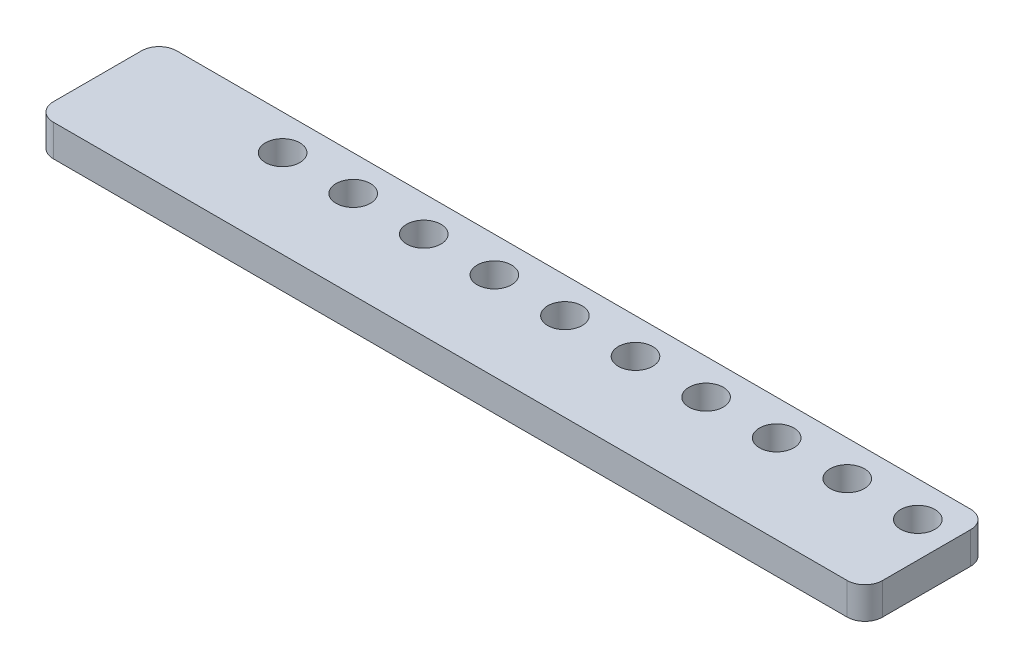
ISO-10303-21;
HEADER;
FILE_DESCRIPTION(('STEP AP214'),'2;1');
FILE_NAME('part.step','',(''),(''),'','','');
FILE_SCHEMA(('AUTOMOTIVE_DESIGN { 1 0 10303 214 1 1 1 1 }'));
ENDSEC;
DATA;
#1=APPLICATION_CONTEXT('core data for automotive mechanical design processes');
#2=APPLICATION_PROTOCOL_DEFINITION('international standard','automotive_design',2000,#1);
#3=PRODUCT_CONTEXT('',#1,'mechanical');
#4=PRODUCT('Part','Part','',(#3));
#5=PRODUCT_RELATED_PRODUCT_CATEGORY('part','',(#4));
#6=PRODUCT_DEFINITION_FORMATION('','',#4);
#7=PRODUCT_DEFINITION_CONTEXT('part definition',#1,'design');
#8=PRODUCT_DEFINITION('design','',#6,#7);
#9=PRODUCT_DEFINITION_SHAPE('','',#8);
#10=(LENGTH_UNIT() NAMED_UNIT(*) SI_UNIT(.MILLI.,.METRE.));
#11=(NAMED_UNIT(*) PLANE_ANGLE_UNIT() SI_UNIT($,.RADIAN.));
#12=(NAMED_UNIT(*) SI_UNIT($,.STERADIAN.) SOLID_ANGLE_UNIT());
#13=UNCERTAINTY_MEASURE_WITH_UNIT(LENGTH_MEASURE(1.E-05),#10,'distance_accuracy_value','');
#14=(GEOMETRIC_REPRESENTATION_CONTEXT(3) GLOBAL_UNCERTAINTY_ASSIGNED_CONTEXT((#13)) GLOBAL_UNIT_ASSIGNED_CONTEXT((#10,
#11,#12)) REPRESENTATION_CONTEXT('',''));
#15=CARTESIAN_POINT('',(0.,0.,0.));
#16=DIRECTION('',(0.,0.,1.));
#17=DIRECTION('',(1.,0.,0.));
#18=AXIS2_PLACEMENT_3D('',#15,#16,#17);
#19=CARTESIAN_POINT('',(92.,3.6,12.));
#20=DIRECTION('',(0.,-1.,0.));
#21=DIRECTION('',(0.,0.,-1.));
#22=AXIS2_PLACEMENT_3D('',#19,#20,#21);
#23=CYLINDRICAL_SURFACE('',#22,2.);
#24=CARTESIAN_POINT('',(92.,0.,12.));
#25=DIRECTION('',(0.,1.,0.));
#26=DIRECTION('',(0.,0.,1.));
#27=AXIS2_PLACEMENT_3D('',#24,#25,#26);
#28=CIRCLE('',#27,2.);
#29=CARTESIAN_POINT('',(92.,0.,14.));
#30=VERTEX_POINT('',#29);
#31=CARTESIAN_POINT('',(94.,0.,12.));
#32=VERTEX_POINT('',#31);
#33=EDGE_CURVE('E129',#30,#32,#28,.T.);
#34=ORIENTED_EDGE('',*,*,#33,.T.);
#35=DIRECTION('',(0.,-1.,0.));
#36=VECTOR('',#35,1.);
#37=CARTESIAN_POINT('',(94.,3.6,12.));
#38=LINE('',#37,#36);
#39=CARTESIAN_POINT('',(94.,3.6,12.));
#40=VERTEX_POINT('',#39);
#41=EDGE_CURVE('E11',#40,#32,#38,.T.);
#42=ORIENTED_EDGE('',*,*,#41,.F.);
#43=CARTESIAN_POINT('',(92.,3.6,12.));
#44=DIRECTION('',(0.,1.,0.));
#45=DIRECTION('',(0.,0.,1.));
#46=AXIS2_PLACEMENT_3D('',#43,#44,#45);
#47=CIRCLE('',#46,2.);
#48=CARTESIAN_POINT('',(92.,3.6,14.));
#49=VERTEX_POINT('',#48);
#50=EDGE_CURVE('E144',#49,#40,#47,.T.);
#51=ORIENTED_EDGE('',*,*,#50,.F.);
#52=DIRECTION('',(0.,-1.,0.));
#53=VECTOR('',#52,1.);
#54=CARTESIAN_POINT('',(92.,3.6,14.));
#55=LINE('',#54,#53);
#56=EDGE_CURVE('E125',#49,#30,#55,.T.);
#57=ORIENTED_EDGE('',*,*,#56,.T.);
#58=EDGE_LOOP('',(#34,#42,#51,#57));
#59=FACE_BOUND('',#58,.T.);
#60=ADVANCED_FACE('F33',(#59),#23,.T.);
#61=CARTESIAN_POINT('',(94.,3.6,2.));
#62=DIRECTION('',(-1.,0.,0.));
#63=DIRECTION('',(0.,0.,1.));
#64=AXIS2_PLACEMENT_3D('',#61,#62,#63);
#65=PLANE('',#64);
#66=DIRECTION('',(0.,0.,-1.));
#67=VECTOR('',#66,1.);
#68=CARTESIAN_POINT('',(94.,0.,2.));
#69=LINE('',#68,#67);
#70=CARTESIAN_POINT('',(94.,0.,2.));
#71=VERTEX_POINT('',#70);
#72=EDGE_CURVE('E132',#32,#71,#69,.T.);
#73=ORIENTED_EDGE('',*,*,#72,.T.);
#74=DIRECTION('',(0.,-1.,0.));
#75=VECTOR('',#74,1.);
#76=CARTESIAN_POINT('',(94.,3.6,2.));
#77=LINE('',#76,#75);
#78=CARTESIAN_POINT('',(94.,3.6,2.));
#79=VERTEX_POINT('',#78);
#80=EDGE_CURVE('E41',#79,#71,#77,.T.);
#81=ORIENTED_EDGE('',*,*,#80,.F.);
#82=DIRECTION('',(0.,0.,-1.));
#83=VECTOR('',#82,1.);
#84=CARTESIAN_POINT('',(94.,3.6,2.));
#85=LINE('',#84,#83);
#86=EDGE_CURVE('E92',#40,#79,#85,.T.);
#87=ORIENTED_EDGE('',*,*,#86,.F.);
#88=ORIENTED_EDGE('',*,*,#41,.T.);
#89=EDGE_LOOP('',(#73,#81,#87,#88));
#90=FACE_BOUND('',#89,.T.);
#91=ADVANCED_FACE('F284',(#90),#65,.F.);
#92=CARTESIAN_POINT('',(92.,3.6,2.));
#93=DIRECTION('',(0.,-1.,0.));
#94=DIRECTION('',(0.,0.,-1.));
#95=AXIS2_PLACEMENT_3D('',#92,#93,#94);
#96=CYLINDRICAL_SURFACE('',#95,2.);
#97=CARTESIAN_POINT('',(92.,0.,2.));
#98=DIRECTION('',(0.,1.,0.));
#99=DIRECTION('',(0.,0.,-1.));
#100=AXIS2_PLACEMENT_3D('',#97,#98,#99);
#101=CIRCLE('',#100,2.);
#102=CARTESIAN_POINT('',(92.,0.,0.));
#103=VERTEX_POINT('',#102);
#104=EDGE_CURVE('E135',#71,#103,#101,.T.);
#105=ORIENTED_EDGE('',*,*,#104,.T.);
#106=DIRECTION('',(0.,-1.,0.));
#107=VECTOR('',#106,1.);
#108=CARTESIAN_POINT('',(92.,3.6,0.));
#109=LINE('',#108,#107);
#110=CARTESIAN_POINT('',(92.,3.6,0.));
#111=VERTEX_POINT('',#110);
#112=EDGE_CURVE('E151',#111,#103,#109,.T.);
#113=ORIENTED_EDGE('',*,*,#112,.F.);
#114=CARTESIAN_POINT('',(92.,3.6,2.));
#115=DIRECTION('',(0.,1.,0.));
#116=DIRECTION('',(0.,0.,-1.));
#117=AXIS2_PLACEMENT_3D('',#114,#115,#116);
#118=CIRCLE('',#117,2.);
#119=EDGE_CURVE('E159',#79,#111,#118,.T.);
#120=ORIENTED_EDGE('',*,*,#119,.F.);
#121=ORIENTED_EDGE('',*,*,#80,.T.);
#122=EDGE_LOOP('',(#105,#113,#120,#121));
#123=FACE_BOUND('',#122,.T.);
#124=ADVANCED_FACE('F157',(#123),#96,.T.);
#125=CARTESIAN_POINT('',(2.00000000000001,3.6,0.));
#126=DIRECTION('',(0.,0.,1.));
#127=DIRECTION('',(1.,0.,0.));
#128=AXIS2_PLACEMENT_3D('',#125,#126,#127);
#129=PLANE('',#128);
#130=DIRECTION('',(-1.,0.,0.));
#131=VECTOR('',#130,1.);
#132=CARTESIAN_POINT('',(2.00000000000001,0.,0.));
#133=LINE('',#132,#131);
#134=CARTESIAN_POINT('',(2.00000000000001,0.,0.));
#135=VERTEX_POINT('',#134);
#136=EDGE_CURVE('E137',#103,#135,#133,.T.);
#137=ORIENTED_EDGE('',*,*,#136,.T.);
#138=DIRECTION('',(0.,-1.,0.));
#139=VECTOR('',#138,1.);
#140=CARTESIAN_POINT('',(2.00000000000001,3.6,0.));
#141=LINE('',#140,#139);
#142=CARTESIAN_POINT('',(2.00000000000001,3.6,0.));
#143=VERTEX_POINT('',#142);
#144=EDGE_CURVE('E148',#143,#135,#141,.T.);
#145=ORIENTED_EDGE('',*,*,#144,.F.);
#146=DIRECTION('',(-1.,0.,0.));
#147=VECTOR('',#146,1.);
#148=CARTESIAN_POINT('',(2.00000000000001,3.6,0.));
#149=LINE('',#148,#147);
#150=EDGE_CURVE('E171',#111,#143,#149,.T.);
#151=ORIENTED_EDGE('',*,*,#150,.F.);
#152=ORIENTED_EDGE('',*,*,#112,.T.);
#153=EDGE_LOOP('',(#137,#145,#151,#152));
#154=FACE_BOUND('',#153,.T.);
#155=ADVANCED_FACE('F167',(#154),#129,.F.);
#156=CARTESIAN_POINT('',(2.,3.6,2.));
#157=DIRECTION('',(0.,-1.,0.));
#158=DIRECTION('',(0.,0.,-1.));
#159=AXIS2_PLACEMENT_3D('',#156,#157,#158);
#160=CYLINDRICAL_SURFACE('',#159,2.);
#161=CARTESIAN_POINT('',(2.,0.,2.));
#162=DIRECTION('',(0.,1.,0.));
#163=DIRECTION('',(0.,0.,1.));
#164=AXIS2_PLACEMENT_3D('',#161,#162,#163);
#165=CIRCLE('',#164,2.);
#166=CARTESIAN_POINT('',(0.,0.,2.00000000000001));
#167=VERTEX_POINT('',#166);
#168=EDGE_CURVE('E139',#135,#167,#165,.T.);
#169=ORIENTED_EDGE('',*,*,#168,.T.);
#170=DIRECTION('',(0.,-1.,0.));
#171=VECTOR('',#170,1.);
#172=CARTESIAN_POINT('',(0.,3.6,2.00000000000001));
#173=LINE('',#172,#171);
#174=CARTESIAN_POINT('',(0.,3.6,2.00000000000001));
#175=VERTEX_POINT('',#174);
#176=EDGE_CURVE('E120',#175,#167,#173,.T.);
#177=ORIENTED_EDGE('',*,*,#176,.F.);
#178=CARTESIAN_POINT('',(2.,3.6,2.));
#179=DIRECTION('',(0.,1.,0.));
#180=DIRECTION('',(0.,0.,1.));
#181=AXIS2_PLACEMENT_3D('',#178,#179,#180);
#182=CIRCLE('',#181,2.);
#183=EDGE_CURVE('E111',#143,#175,#182,.T.);
#184=ORIENTED_EDGE('',*,*,#183,.F.);
#185=ORIENTED_EDGE('',*,*,#144,.T.);
#186=EDGE_LOOP('',(#169,#177,#184,#185));
#187=FACE_BOUND('',#186,.T.);
#188=ADVANCED_FACE('F170',(#187),#160,.T.);
#189=CARTESIAN_POINT('',(0.,3.6,2.00000000000001));
#190=DIRECTION('',(1.,0.,0.));
#191=DIRECTION('',(0.,0.,-1.));
#192=AXIS2_PLACEMENT_3D('',#189,#190,#191);
#193=PLANE('',#192);
#194=DIRECTION('',(0.,0.,1.));
#195=VECTOR('',#194,1.);
#196=CARTESIAN_POINT('',(0.,0.,2.00000000000001));
#197=LINE('',#196,#195);
#198=CARTESIAN_POINT('',(0.,0.,12.));
#199=VERTEX_POINT('',#198);
#200=EDGE_CURVE('E119',#167,#199,#197,.T.);
#201=ORIENTED_EDGE('',*,*,#200,.T.);
#202=DIRECTION('',(0.,-1.,0.));
#203=VECTOR('',#202,1.);
#204=CARTESIAN_POINT('',(0.,3.6,12.));
#205=LINE('',#204,#203);
#206=CARTESIAN_POINT('',(0.,3.6,12.));
#207=VERTEX_POINT('',#206);
#208=EDGE_CURVE('E116',#207,#199,#205,.T.);
#209=ORIENTED_EDGE('',*,*,#208,.F.);
#210=DIRECTION('',(0.,0.,1.));
#211=VECTOR('',#210,1.);
#212=CARTESIAN_POINT('',(0.,3.6,2.00000000000001));
#213=LINE('',#212,#211);
#214=EDGE_CURVE('E105',#175,#207,#213,.T.);
#215=ORIENTED_EDGE('',*,*,#214,.F.);
#216=ORIENTED_EDGE('',*,*,#176,.T.);
#217=EDGE_LOOP('',(#201,#209,#215,#216));
#218=FACE_BOUND('',#217,.T.);
#219=ADVANCED_FACE('F117',(#218),#193,.F.);
#220=CARTESIAN_POINT('',(2.,3.6,12.));
#221=DIRECTION('',(0.,-1.,0.));
#222=DIRECTION('',(0.,0.,-1.));
#223=AXIS2_PLACEMENT_3D('',#220,#221,#222);
#224=CYLINDRICAL_SURFACE('',#223,2.);
#225=CARTESIAN_POINT('',(2.,0.,12.));
#226=DIRECTION('',(0.,1.,0.));
#227=DIRECTION('',(0.,0.,1.));
#228=AXIS2_PLACEMENT_3D('',#225,#226,#227);
#229=CIRCLE('',#228,2.);
#230=CARTESIAN_POINT('',(2.,0.,14.));
#231=VERTEX_POINT('',#230);
#232=EDGE_CURVE('E78',#199,#231,#229,.T.);
#233=ORIENTED_EDGE('',*,*,#232,.T.);
#234=DIRECTION('',(0.,-1.,0.));
#235=VECTOR('',#234,1.);
#236=CARTESIAN_POINT('',(2.,3.6,14.));
#237=LINE('',#236,#235);
#238=CARTESIAN_POINT('',(2.,3.6,14.));
#239=VERTEX_POINT('',#238);
#240=EDGE_CURVE('E121',#239,#231,#237,.T.);
#241=ORIENTED_EDGE('',*,*,#240,.F.);
#242=CARTESIAN_POINT('',(2.,3.6,12.));
#243=DIRECTION('',(0.,1.,0.));
#244=DIRECTION('',(0.,0.,1.));
#245=AXIS2_PLACEMENT_3D('',#242,#243,#244);
#246=CIRCLE('',#245,2.);
#247=EDGE_CURVE('E109',#207,#239,#246,.T.);
#248=ORIENTED_EDGE('',*,*,#247,.F.);
#249=ORIENTED_EDGE('',*,*,#208,.T.);
#250=EDGE_LOOP('',(#233,#241,#248,#249));
#251=FACE_BOUND('',#250,.T.);
#252=ADVANCED_FACE('F123',(#251),#224,.T.);
#253=CARTESIAN_POINT('',(2.,3.6,14.));
#254=DIRECTION('',(0.,0.,-1.));
#255=DIRECTION('',(-1.,0.,0.));
#256=AXIS2_PLACEMENT_3D('',#253,#254,#255);
#257=PLANE('',#256);
#258=DIRECTION('',(1.,0.,0.));
#259=VECTOR('',#258,1.);
#260=CARTESIAN_POINT('',(2.,0.,14.));
#261=LINE('',#260,#259);
#262=EDGE_CURVE('E84',#231,#30,#261,.T.);
#263=ORIENTED_EDGE('',*,*,#262,.T.);
#264=ORIENTED_EDGE('',*,*,#56,.F.);
#265=DIRECTION('',(1.,0.,0.));
#266=VECTOR('',#265,1.);
#267=CARTESIAN_POINT('',(2.,3.6,14.));
#268=LINE('',#267,#266);
#269=EDGE_CURVE('E49',#239,#49,#268,.T.);
#270=ORIENTED_EDGE('',*,*,#269,.F.);
#271=ORIENTED_EDGE('',*,*,#240,.T.);
#272=EDGE_LOOP('',(#263,#264,#270,#271));
#273=FACE_BOUND('',#272,.T.);
#274=ADVANCED_FACE('F248',(#273),#257,.F.);
#275=CARTESIAN_POINT('',(92.,3.6,12.));
#276=DIRECTION('',(0.,1.,0.));
#277=DIRECTION('',(0.,0.,1.));
#278=AXIS2_PLACEMENT_3D('',#275,#276,#277);
#279=PLANE('',#278);
#280=CARTESIAN_POINT('',(90.,3.6,4.));
#281=DIRECTION('',(0.,1.,0.));
#282=DIRECTION('',(0.,0.,1.));
#283=AXIS2_PLACEMENT_3D('',#280,#281,#282);
#284=CIRCLE('',#283,1.95);
#285=CARTESIAN_POINT('',(90.,3.6,5.95));
#286=VERTEX_POINT('',#285);
#287=EDGE_CURVE('E190',#286,#286,#284,.T.);
#288=ORIENTED_EDGE('',*,*,#287,.F.);
#289=EDGE_LOOP('',(#288));
#290=FACE_BOUND('',#289,.T.);
#291=CARTESIAN_POINT('',(74.,3.6,4.));
#292=DIRECTION('',(0.,1.,0.));
#293=DIRECTION('',(0.,0.,1.));
#294=AXIS2_PLACEMENT_3D('',#291,#292,#293);
#295=CIRCLE('',#294,1.95);
#296=CARTESIAN_POINT('',(74.,3.6,5.95));
#297=VERTEX_POINT('',#296);
#298=EDGE_CURVE('E227',#297,#297,#295,.T.);
#299=ORIENTED_EDGE('',*,*,#298,.F.);
#300=EDGE_LOOP('',(#299));
#301=FACE_BOUND('',#300,.T.);
#302=CARTESIAN_POINT('',(34.,3.6,4.00000000000001));
#303=DIRECTION('',(0.,1.,0.));
#304=DIRECTION('',(0.,0.,1.));
#305=AXIS2_PLACEMENT_3D('',#302,#303,#304);
#306=CIRCLE('',#305,1.95);
#307=CARTESIAN_POINT('',(34.,3.6,5.95000000000001));
#308=VERTEX_POINT('',#307);
#309=EDGE_CURVE('E191',#308,#308,#306,.T.);
#310=ORIENTED_EDGE('',*,*,#309,.F.);
#311=EDGE_LOOP('',(#310));
#312=FACE_BOUND('',#311,.T.);
#313=CARTESIAN_POINT('',(26.,3.6,4.00000000000001));
#314=DIRECTION('',(0.,1.,0.));
#315=DIRECTION('',(0.,0.,1.));
#316=AXIS2_PLACEMENT_3D('',#313,#314,#315);
#317=CIRCLE('',#316,1.95);
#318=CARTESIAN_POINT('',(26.,3.6,5.95000000000001));
#319=VERTEX_POINT('',#318);
#320=EDGE_CURVE('E198',#319,#319,#317,.T.);
#321=ORIENTED_EDGE('',*,*,#320,.F.);
#322=EDGE_LOOP('',(#321));
#323=FACE_BOUND('',#322,.T.);
#324=CARTESIAN_POINT('',(18.,3.6,4.00000000000001));
#325=DIRECTION('',(0.,1.,0.));
#326=DIRECTION('',(0.,0.,1.));
#327=AXIS2_PLACEMENT_3D('',#324,#325,#326);
#328=CIRCLE('',#327,1.95);
#329=CARTESIAN_POINT('',(18.,3.6,5.95000000000001));
#330=VERTEX_POINT('',#329);
#331=EDGE_CURVE('E177',#330,#330,#328,.T.);
#332=ORIENTED_EDGE('',*,*,#331,.F.);
#333=EDGE_LOOP('',(#332));
#334=FACE_BOUND('',#333,.T.);
#335=CARTESIAN_POINT('',(82.,3.6,4.));
#336=DIRECTION('',(0.,1.,0.));
#337=DIRECTION('',(0.,0.,1.));
#338=AXIS2_PLACEMENT_3D('',#335,#336,#337);
#339=CIRCLE('',#338,1.95);
#340=CARTESIAN_POINT('',(82.,3.6,5.95));
#341=VERTEX_POINT('',#340);
#342=EDGE_CURVE('E184',#341,#341,#339,.T.);
#343=ORIENTED_EDGE('',*,*,#342,.F.);
#344=EDGE_LOOP('',(#343));
#345=FACE_BOUND('',#344,.T.);
#346=CARTESIAN_POINT('',(42.,3.6,4.00000000000001));
#347=DIRECTION('',(0.,1.,0.));
#348=DIRECTION('',(0.,0.,1.));
#349=AXIS2_PLACEMENT_3D('',#346,#347,#348);
#350=CIRCLE('',#349,1.95);
#351=CARTESIAN_POINT('',(42.,3.6,5.95));
#352=VERTEX_POINT('',#351);
#353=EDGE_CURVE('E222',#352,#352,#350,.T.);
#354=ORIENTED_EDGE('',*,*,#353,.F.);
#355=EDGE_LOOP('',(#354));
#356=FACE_BOUND('',#355,.T.);
#357=CARTESIAN_POINT('',(50.,3.6,4.));
#358=DIRECTION('',(0.,1.,0.));
#359=DIRECTION('',(0.,0.,1.));
#360=AXIS2_PLACEMENT_3D('',#357,#358,#359);
#361=CIRCLE('',#360,1.95);
#362=CARTESIAN_POINT('',(50.,3.6,5.95));
#363=VERTEX_POINT('',#362);
#364=EDGE_CURVE('E216',#363,#363,#361,.T.);
#365=ORIENTED_EDGE('',*,*,#364,.F.);
#366=EDGE_LOOP('',(#365));
#367=FACE_BOUND('',#366,.T.);
#368=CARTESIAN_POINT('',(58.,3.6,4.));
#369=DIRECTION('',(0.,1.,0.));
#370=DIRECTION('',(0.,0.,1.));
#371=AXIS2_PLACEMENT_3D('',#368,#369,#370);
#372=CIRCLE('',#371,1.95);
#373=CARTESIAN_POINT('',(58.,3.6,5.95));
#374=VERTEX_POINT('',#373);
#375=EDGE_CURVE('E210',#374,#374,#372,.T.);
#376=ORIENTED_EDGE('',*,*,#375,.F.);
#377=EDGE_LOOP('',(#376));
#378=FACE_BOUND('',#377,.T.);
#379=CARTESIAN_POINT('',(66.,3.6,4.));
#380=DIRECTION('',(0.,1.,0.));
#381=DIRECTION('',(0.,0.,1.));
#382=AXIS2_PLACEMENT_3D('',#379,#380,#381);
#383=CIRCLE('',#382,1.95);
#384=CARTESIAN_POINT('',(66.,3.6,5.95));
#385=VERTEX_POINT('',#384);
#386=EDGE_CURVE('E203',#385,#385,#383,.T.);
#387=ORIENTED_EDGE('',*,*,#386,.F.);
#388=EDGE_LOOP('',(#387));
#389=FACE_BOUND('',#388,.T.);
#390=ORIENTED_EDGE('',*,*,#50,.T.);
#391=ORIENTED_EDGE('',*,*,#86,.T.);
#392=ORIENTED_EDGE('',*,*,#119,.T.);
#393=ORIENTED_EDGE('',*,*,#150,.T.);
#394=ORIENTED_EDGE('',*,*,#183,.T.);
#395=ORIENTED_EDGE('',*,*,#214,.T.);
#396=ORIENTED_EDGE('',*,*,#247,.T.);
#397=ORIENTED_EDGE('',*,*,#269,.T.);
#398=EDGE_LOOP('',(#390,#391,#392,#393,#394,#395,#396,#397));
#399=FACE_BOUND('',#398,.T.);
#400=ADVANCED_FACE('F107',(#290,#301,#312,#323,#334,#345,#356,#367,#378,#389,#399),#279,.T.);
#401=CARTESIAN_POINT('',(92.,0.,12.));
#402=DIRECTION('',(0.,1.,0.));
#403=DIRECTION('',(0.,0.,1.));
#404=AXIS2_PLACEMENT_3D('',#401,#402,#403);
#405=PLANE('',#404);
#406=CARTESIAN_POINT('',(90.,0.,4.));
#407=DIRECTION('',(0.,1.,0.));
#408=DIRECTION('',(0.,0.,1.));
#409=AXIS2_PLACEMENT_3D('',#406,#407,#408);
#410=CIRCLE('',#409,1.95);
#411=CARTESIAN_POINT('',(90.,0.,5.95));
#412=VERTEX_POINT('',#411);
#413=EDGE_CURVE('E133',#412,#412,#410,.T.);
#414=ORIENTED_EDGE('',*,*,#413,.T.);
#415=EDGE_LOOP('',(#414));
#416=FACE_BOUND('',#415,.T.);
#417=CARTESIAN_POINT('',(74.,0.,4.));
#418=DIRECTION('',(0.,1.,0.));
#419=DIRECTION('',(0.,0.,1.));
#420=AXIS2_PLACEMENT_3D('',#417,#418,#419);
#421=CIRCLE('',#420,1.95);
#422=CARTESIAN_POINT('',(74.,0.,5.95));
#423=VERTEX_POINT('',#422);
#424=EDGE_CURVE('E207',#423,#423,#421,.T.);
#425=ORIENTED_EDGE('',*,*,#424,.T.);
#426=EDGE_LOOP('',(#425));
#427=FACE_BOUND('',#426,.T.);
#428=CARTESIAN_POINT('',(34.,0.,4.00000000000001));
#429=DIRECTION('',(0.,1.,0.));
#430=DIRECTION('',(0.,0.,1.));
#431=AXIS2_PLACEMENT_3D('',#428,#429,#430);
#432=CIRCLE('',#431,1.95);
#433=CARTESIAN_POINT('',(34.,0.,5.95000000000001));
#434=VERTEX_POINT('',#433);
#435=EDGE_CURVE('E194',#434,#434,#432,.T.);
#436=ORIENTED_EDGE('',*,*,#435,.T.);
#437=EDGE_LOOP('',(#436));
#438=FACE_BOUND('',#437,.T.);
#439=CARTESIAN_POINT('',(26.,0.,4.00000000000001));
#440=DIRECTION('',(0.,1.,0.));
#441=DIRECTION('',(0.,0.,1.));
#442=AXIS2_PLACEMENT_3D('',#439,#440,#441);
#443=CIRCLE('',#442,1.95);
#444=CARTESIAN_POINT('',(26.,0.,5.95000000000001));
#445=VERTEX_POINT('',#444);
#446=EDGE_CURVE('E181',#445,#445,#443,.T.);
#447=ORIENTED_EDGE('',*,*,#446,.T.);
#448=EDGE_LOOP('',(#447));
#449=FACE_BOUND('',#448,.T.);
#450=CARTESIAN_POINT('',(18.,0.,4.00000000000001));
#451=DIRECTION('',(0.,1.,0.));
#452=DIRECTION('',(0.,0.,1.));
#453=AXIS2_PLACEMENT_3D('',#450,#451,#452);
#454=CIRCLE('',#453,1.95);
#455=CARTESIAN_POINT('',(18.,0.,5.95000000000001));
#456=VERTEX_POINT('',#455);
#457=EDGE_CURVE('E180',#456,#456,#454,.T.);
#458=ORIENTED_EDGE('',*,*,#457,.T.);
#459=EDGE_LOOP('',(#458));
#460=FACE_BOUND('',#459,.T.);
#461=CARTESIAN_POINT('',(82.,0.,4.));
#462=DIRECTION('',(0.,1.,0.));
#463=DIRECTION('',(0.,0.,1.));
#464=AXIS2_PLACEMENT_3D('',#461,#462,#463);
#465=CIRCLE('',#464,1.95);
#466=CARTESIAN_POINT('',(82.,0.,5.95));
#467=VERTEX_POINT('',#466);
#468=EDGE_CURVE('E187',#467,#467,#465,.T.);
#469=ORIENTED_EDGE('',*,*,#468,.T.);
#470=EDGE_LOOP('',(#469));
#471=FACE_BOUND('',#470,.T.);
#472=CARTESIAN_POINT('',(42.,0.,4.00000000000001));
#473=DIRECTION('',(0.,1.,0.));
#474=DIRECTION('',(0.,0.,1.));
#475=AXIS2_PLACEMENT_3D('',#472,#473,#474);
#476=CIRCLE('',#475,1.95);
#477=CARTESIAN_POINT('',(42.,0.,5.95));
#478=VERTEX_POINT('',#477);
#479=EDGE_CURVE('E195',#478,#478,#476,.T.);
#480=ORIENTED_EDGE('',*,*,#479,.T.);
#481=EDGE_LOOP('',(#480));
#482=FACE_BOUND('',#481,.T.);
#483=CARTESIAN_POINT('',(50.,0.,4.));
#484=DIRECTION('',(0.,1.,0.));
#485=DIRECTION('',(0.,0.,1.));
#486=AXIS2_PLACEMENT_3D('',#483,#484,#485);
#487=CIRCLE('',#486,1.95);
#488=CARTESIAN_POINT('',(50.,0.,5.95));
#489=VERTEX_POINT('',#488);
#490=EDGE_CURVE('E219',#489,#489,#487,.T.);
#491=ORIENTED_EDGE('',*,*,#490,.T.);
#492=EDGE_LOOP('',(#491));
#493=FACE_BOUND('',#492,.T.);
#494=CARTESIAN_POINT('',(58.,0.,4.));
#495=DIRECTION('',(0.,1.,0.));
#496=DIRECTION('',(0.,0.,1.));
#497=AXIS2_PLACEMENT_3D('',#494,#495,#496);
#498=CIRCLE('',#497,1.95);
#499=CARTESIAN_POINT('',(58.,0.,5.95));
#500=VERTEX_POINT('',#499);
#501=EDGE_CURVE('E213',#500,#500,#498,.T.);
#502=ORIENTED_EDGE('',*,*,#501,.T.);
#503=EDGE_LOOP('',(#502));
#504=FACE_BOUND('',#503,.T.);
#505=CARTESIAN_POINT('',(66.,0.,4.));
#506=DIRECTION('',(0.,1.,0.));
#507=DIRECTION('',(0.,0.,1.));
#508=AXIS2_PLACEMENT_3D('',#505,#506,#507);
#509=CIRCLE('',#508,1.95);
#510=CARTESIAN_POINT('',(66.,0.,5.95));
#511=VERTEX_POINT('',#510);
#512=EDGE_CURVE('E206',#511,#511,#509,.T.);
#513=ORIENTED_EDGE('',*,*,#512,.T.);
#514=EDGE_LOOP('',(#513));
#515=FACE_BOUND('',#514,.T.);
#516=ORIENTED_EDGE('',*,*,#33,.F.);
#517=ORIENTED_EDGE('',*,*,#262,.F.);
#518=ORIENTED_EDGE('',*,*,#232,.F.);
#519=ORIENTED_EDGE('',*,*,#200,.F.);
#520=ORIENTED_EDGE('',*,*,#168,.F.);
#521=ORIENTED_EDGE('',*,*,#136,.F.);
#522=ORIENTED_EDGE('',*,*,#104,.F.);
#523=ORIENTED_EDGE('',*,*,#72,.F.);
#524=EDGE_LOOP('',(#516,#517,#518,#519,#520,#521,#522,#523));
#525=FACE_BOUND('',#524,.T.);
#526=ADVANCED_FACE('F163',(#416,#427,#438,#449,#460,#471,#482,#493,#504,#515,#525),#405,.F.);
#527=CARTESIAN_POINT('',(66.,0.,4.));
#528=DIRECTION('',(0.,1.,0.));
#529=DIRECTION('',(0.,0.,1.));
#530=AXIS2_PLACEMENT_3D('',#527,#528,#529);
#531=CYLINDRICAL_SURFACE('',#530,1.95);
#532=ORIENTED_EDGE('',*,*,#512,.F.);
#533=EDGE_LOOP('',(#532));
#534=FACE_BOUND('',#533,.T.);
#535=ORIENTED_EDGE('',*,*,#386,.T.);
#536=EDGE_LOOP('',(#535));
#537=FACE_BOUND('',#536,.T.);
#538=ADVANCED_FACE('F268',(#534,#537),#531,.F.);
#539=CARTESIAN_POINT('',(58.,0.,4.));
#540=DIRECTION('',(0.,1.,0.));
#541=DIRECTION('',(0.,0.,1.));
#542=AXIS2_PLACEMENT_3D('',#539,#540,#541);
#543=CYLINDRICAL_SURFACE('',#542,1.95);
#544=ORIENTED_EDGE('',*,*,#501,.F.);
#545=EDGE_LOOP('',(#544));
#546=FACE_BOUND('',#545,.T.);
#547=ORIENTED_EDGE('',*,*,#375,.T.);
#548=EDGE_LOOP('',(#547));
#549=FACE_BOUND('',#548,.T.);
#550=ADVANCED_FACE('F270',(#546,#549),#543,.F.);
#551=CARTESIAN_POINT('',(50.,0.,4.));
#552=DIRECTION('',(0.,1.,0.));
#553=DIRECTION('',(0.,0.,1.));
#554=AXIS2_PLACEMENT_3D('',#551,#552,#553);
#555=CYLINDRICAL_SURFACE('',#554,1.95);
#556=ORIENTED_EDGE('',*,*,#490,.F.);
#557=EDGE_LOOP('',(#556));
#558=FACE_BOUND('',#557,.T.);
#559=ORIENTED_EDGE('',*,*,#364,.T.);
#560=EDGE_LOOP('',(#559));
#561=FACE_BOUND('',#560,.T.);
#562=ADVANCED_FACE('F277',(#558,#561),#555,.F.);
#563=CARTESIAN_POINT('',(42.,0.,4.00000000000001));
#564=DIRECTION('',(0.,1.,0.));
#565=DIRECTION('',(0.,0.,1.));
#566=AXIS2_PLACEMENT_3D('',#563,#564,#565);
#567=CYLINDRICAL_SURFACE('',#566,1.95);
#568=ORIENTED_EDGE('',*,*,#479,.F.);
#569=EDGE_LOOP('',(#568));
#570=FACE_BOUND('',#569,.T.);
#571=ORIENTED_EDGE('',*,*,#353,.T.);
#572=EDGE_LOOP('',(#571));
#573=FACE_BOUND('',#572,.T.);
#574=ADVANCED_FACE('F360',(#570,#573),#567,.F.);
#575=CARTESIAN_POINT('',(82.,0.,4.));
#576=DIRECTION('',(0.,1.,0.));
#577=DIRECTION('',(0.,0.,1.));
#578=AXIS2_PLACEMENT_3D('',#575,#576,#577);
#579=CYLINDRICAL_SURFACE('',#578,1.95);
#580=ORIENTED_EDGE('',*,*,#468,.F.);
#581=EDGE_LOOP('',(#580));
#582=FACE_BOUND('',#581,.T.);
#583=ORIENTED_EDGE('',*,*,#342,.T.);
#584=EDGE_LOOP('',(#583));
#585=FACE_BOUND('',#584,.T.);
#586=ADVANCED_FACE('F370',(#582,#585),#579,.F.);
#587=CARTESIAN_POINT('',(18.,0.,4.00000000000001));
#588=DIRECTION('',(0.,1.,0.));
#589=DIRECTION('',(0.,0.,1.));
#590=AXIS2_PLACEMENT_3D('',#587,#588,#589);
#591=CYLINDRICAL_SURFACE('',#590,1.95);
#592=ORIENTED_EDGE('',*,*,#457,.F.);
#593=EDGE_LOOP('',(#592));
#594=FACE_BOUND('',#593,.T.);
#595=ORIENTED_EDGE('',*,*,#331,.T.);
#596=EDGE_LOOP('',(#595));
#597=FACE_BOUND('',#596,.T.);
#598=ADVANCED_FACE('F380',(#594,#597),#591,.F.);
#599=CARTESIAN_POINT('',(26.,0.,4.00000000000001));
#600=DIRECTION('',(0.,1.,0.));
#601=DIRECTION('',(0.,0.,1.));
#602=AXIS2_PLACEMENT_3D('',#599,#600,#601);
#603=CYLINDRICAL_SURFACE('',#602,1.95);
#604=ORIENTED_EDGE('',*,*,#446,.F.);
#605=EDGE_LOOP('',(#604));
#606=FACE_BOUND('',#605,.T.);
#607=ORIENTED_EDGE('',*,*,#320,.T.);
#608=EDGE_LOOP('',(#607));
#609=FACE_BOUND('',#608,.T.);
#610=ADVANCED_FACE('F390',(#606,#609),#603,.F.);
#611=CARTESIAN_POINT('',(34.,0.,4.00000000000001));
#612=DIRECTION('',(0.,1.,0.));
#613=DIRECTION('',(0.,0.,1.));
#614=AXIS2_PLACEMENT_3D('',#611,#612,#613);
#615=CYLINDRICAL_SURFACE('',#614,1.95);
#616=ORIENTED_EDGE('',*,*,#435,.F.);
#617=EDGE_LOOP('',(#616));
#618=FACE_BOUND('',#617,.T.);
#619=ORIENTED_EDGE('',*,*,#309,.T.);
#620=EDGE_LOOP('',(#619));
#621=FACE_BOUND('',#620,.T.);
#622=ADVANCED_FACE('F400',(#618,#621),#615,.F.);
#623=CARTESIAN_POINT('',(74.,0.,4.));
#624=DIRECTION('',(0.,1.,0.));
#625=DIRECTION('',(0.,0.,1.));
#626=AXIS2_PLACEMENT_3D('',#623,#624,#625);
#627=CYLINDRICAL_SURFACE('',#626,1.95);
#628=ORIENTED_EDGE('',*,*,#424,.F.);
#629=EDGE_LOOP('',(#628));
#630=FACE_BOUND('',#629,.T.);
#631=ORIENTED_EDGE('',*,*,#298,.T.);
#632=EDGE_LOOP('',(#631));
#633=FACE_BOUND('',#632,.T.);
#634=ADVANCED_FACE('F242',(#630,#633),#627,.F.);
#635=CARTESIAN_POINT('',(90.,0.,4.));
#636=DIRECTION('',(0.,1.,0.));
#637=DIRECTION('',(0.,0.,1.));
#638=AXIS2_PLACEMENT_3D('',#635,#636,#637);
#639=CYLINDRICAL_SURFACE('',#638,1.95);
#640=ORIENTED_EDGE('',*,*,#413,.F.);
#641=EDGE_LOOP('',(#640));
#642=FACE_BOUND('',#641,.T.);
#643=ORIENTED_EDGE('',*,*,#287,.T.);
#644=EDGE_LOOP('',(#643));
#645=FACE_BOUND('',#644,.T.);
#646=ADVANCED_FACE('F239',(#642,#645),#639,.F.);
#647=CLOSED_SHELL('',(#60,#91,#124,#155,#188,#219,#252,#274,#400,#526,#538,#550,#562,#574,#586,
#598,#610,#622,#634,#646));
#648=MANIFOLD_SOLID_BREP('B2',#647);
#649=ADVANCED_BREP_SHAPE_REPRESENTATION('',(#18,#648),#14);
#650=SHAPE_DEFINITION_REPRESENTATION(#9,#649);
ENDSEC;
END-ISO-10303-21;
